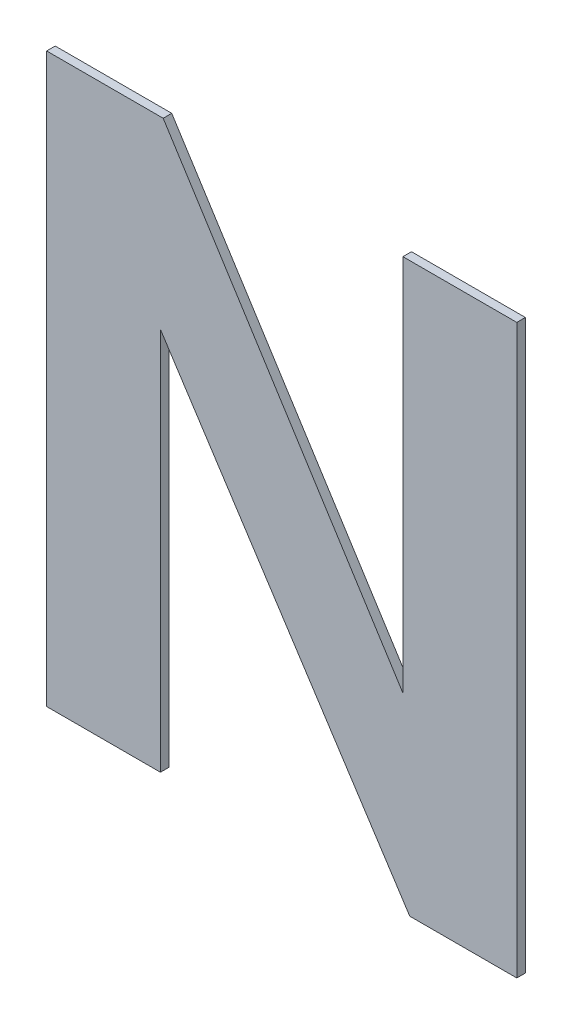
ISO-10303-21;
HEADER;
FILE_DESCRIPTION(('STEP AP214'),'2;1');
FILE_NAME('part.step','',(''),(''),'','','');
FILE_SCHEMA(('AUTOMOTIVE_DESIGN { 1 0 10303 214 1 1 1 1 }'));
ENDSEC;
DATA;
#1=APPLICATION_CONTEXT('core data for automotive mechanical design processes');
#2=APPLICATION_PROTOCOL_DEFINITION('international standard','automotive_design',2000,#1);
#3=PRODUCT_CONTEXT('',#1,'mechanical');
#4=PRODUCT('Part','Part','',(#3));
#5=PRODUCT_RELATED_PRODUCT_CATEGORY('part','',(#4));
#6=PRODUCT_DEFINITION_FORMATION('','',#4);
#7=PRODUCT_DEFINITION_CONTEXT('part definition',#1,'design');
#8=PRODUCT_DEFINITION('design','',#6,#7);
#9=PRODUCT_DEFINITION_SHAPE('','',#8);
#10=(LENGTH_UNIT() NAMED_UNIT(*) SI_UNIT(.MILLI.,.METRE.));
#11=(NAMED_UNIT(*) PLANE_ANGLE_UNIT() SI_UNIT($,.RADIAN.));
#12=(NAMED_UNIT(*) SI_UNIT($,.STERADIAN.) SOLID_ANGLE_UNIT());
#13=UNCERTAINTY_MEASURE_WITH_UNIT(LENGTH_MEASURE(1.E-05),#10,'distance_accuracy_value','');
#14=(GEOMETRIC_REPRESENTATION_CONTEXT(3) GLOBAL_UNCERTAINTY_ASSIGNED_CONTEXT((#13)) GLOBAL_UNIT_ASSIGNED_CONTEXT((#10,
#11,#12)) REPRESENTATION_CONTEXT('',''));
#15=CARTESIAN_POINT('',(0.,0.,0.));
#16=DIRECTION('',(0.,0.,1.));
#17=DIRECTION('',(1.,0.,0.));
#18=AXIS2_PLACEMENT_3D('',#15,#16,#17);
#19=CARTESIAN_POINT('',(3.0557891120453,-0.677335704041417,0.));
#20=DIRECTION('',(0.,-1.,0.));
#21=DIRECTION('',(1.,0.,0.));
#22=AXIS2_PLACEMENT_3D('',#19,#20,#21);
#23=PLANE('',#22);
#24=DIRECTION('',(1.,0.,0.));
#25=VECTOR('',#24,1.);
#26=CARTESIAN_POINT('',(3.0557891120453,-0.677335704041417,0.));
#27=LINE('',#26,#25);
#28=CARTESIAN_POINT('',(3.0557891120453,-0.677335704041417,0.));
#29=VERTEX_POINT('',#28);
#30=CARTESIAN_POINT('',(3.0956408964429,-0.677335704041417,0.));
#31=VERTEX_POINT('',#30);
#32=EDGE_CURVE('E11',#29,#31,#27,.T.);
#33=ORIENTED_EDGE('',*,*,#32,.T.);
#34=DIRECTION('',(0.,0.,1.));
#35=VECTOR('',#34,1.);
#36=CARTESIAN_POINT('',(3.0956408964429,-0.677335704041417,0.));
#37=LINE('',#36,#35);
#38=CARTESIAN_POINT('',(3.0956408964429,-0.677335704041417,0.003));
#39=VERTEX_POINT('',#38);
#40=EDGE_CURVE('E24',#31,#39,#37,.T.);
#41=ORIENTED_EDGE('',*,*,#40,.T.);
#42=DIRECTION('',(1.,0.,0.));
#43=VECTOR('',#42,1.);
#44=CARTESIAN_POINT('',(3.0557891120453,-0.677335704041417,0.003));
#45=LINE('',#44,#43);
#46=CARTESIAN_POINT('',(3.0557891120453,-0.677335704041417,0.003));
#47=VERTEX_POINT('',#46);
#48=EDGE_CURVE('E112',#47,#39,#45,.T.);
#49=ORIENTED_EDGE('',*,*,#48,.F.);
#50=DIRECTION('',(0.,0.,1.));
#51=VECTOR('',#50,1.);
#52=CARTESIAN_POINT('',(3.0557891120453,-0.677335704041417,0.));
#53=LINE('',#52,#51);
#54=EDGE_CURVE('E176',#29,#47,#53,.T.);
#55=ORIENTED_EDGE('',*,*,#54,.F.);
#56=EDGE_LOOP('',(#33,#41,#49,#55));
#57=FACE_BOUND('',#56,.T.);
#58=ADVANCED_FACE('F17',(#57),#23,.T.);
#59=CARTESIAN_POINT('',(3.0557891120453,-0.478504002276747,0.));
#60=DIRECTION('',(-1.,0.,0.));
#61=DIRECTION('',(0.,-1.,0.));
#62=AXIS2_PLACEMENT_3D('',#59,#60,#61);
#63=PLANE('',#62);
#64=DIRECTION('',(0.,-1.,0.));
#65=VECTOR('',#64,1.);
#66=CARTESIAN_POINT('',(3.0557891120453,-0.478504002276747,0.));
#67=LINE('',#66,#65);
#68=CARTESIAN_POINT('',(3.0557891120453,-0.478504002276747,0.));
#69=VERTEX_POINT('',#68);
#70=EDGE_CURVE('E173',#69,#29,#67,.T.);
#71=ORIENTED_EDGE('',*,*,#70,.T.);
#72=ORIENTED_EDGE('',*,*,#54,.T.);
#73=DIRECTION('',(0.,-1.,0.));
#74=VECTOR('',#73,1.);
#75=CARTESIAN_POINT('',(3.0557891120453,-0.478504002276747,0.003));
#76=LINE('',#75,#74);
#77=CARTESIAN_POINT('',(3.0557891120453,-0.478504002276747,0.003));
#78=VERTEX_POINT('',#77);
#79=EDGE_CURVE('E171',#78,#47,#76,.T.);
#80=ORIENTED_EDGE('',*,*,#79,.F.);
#81=DIRECTION('',(0.,0.,1.));
#82=VECTOR('',#81,1.);
#83=CARTESIAN_POINT('',(3.0557891120453,-0.478504002276747,0.));
#84=LINE('',#83,#82);
#85=EDGE_CURVE('E168',#69,#78,#84,.T.);
#86=ORIENTED_EDGE('',*,*,#85,.F.);
#87=EDGE_LOOP('',(#71,#72,#80,#86));
#88=FACE_BOUND('',#87,.T.);
#89=ADVANCED_FACE('F199',(#88),#63,.T.);
#90=CARTESIAN_POINT('',(3.0966033260352,-0.478504002276747,0.));
#91=DIRECTION('',(0.,1.,0.));
#92=DIRECTION('',(-1.,0.,0.));
#93=AXIS2_PLACEMENT_3D('',#90,#91,#92);
#94=PLANE('',#93);
#95=DIRECTION('',(-1.,0.,0.));
#96=VECTOR('',#95,1.);
#97=CARTESIAN_POINT('',(3.0966033260352,-0.478504002276747,0.));
#98=LINE('',#97,#96);
#99=CARTESIAN_POINT('',(3.0966033260352,-0.478504002276747,0.));
#100=VERTEX_POINT('',#99);
#101=EDGE_CURVE('E165',#100,#69,#98,.T.);
#102=ORIENTED_EDGE('',*,*,#101,.T.);
#103=ORIENTED_EDGE('',*,*,#85,.T.);
#104=DIRECTION('',(-1.,0.,0.));
#105=VECTOR('',#104,1.);
#106=CARTESIAN_POINT('',(3.0966033260352,-0.478504002276747,0.003));
#107=LINE('',#106,#105);
#108=CARTESIAN_POINT('',(3.0966033260352,-0.478504002276747,0.003));
#109=VERTEX_POINT('',#108);
#110=EDGE_CURVE('E162',#109,#78,#107,.T.);
#111=ORIENTED_EDGE('',*,*,#110,.F.);
#112=DIRECTION('',(0.,0.,1.));
#113=VECTOR('',#112,1.);
#114=CARTESIAN_POINT('',(3.0966033260352,-0.478504002276747,0.));
#115=LINE('',#114,#113);
#116=EDGE_CURVE('E159',#100,#109,#115,.T.);
#117=ORIENTED_EDGE('',*,*,#116,.F.);
#118=EDGE_LOOP('',(#102,#103,#111,#117));
#119=FACE_BOUND('',#118,.T.);
#120=ADVANCED_FACE('F196',(#119),#94,.T.);
#121=CARTESIAN_POINT('',(3.1805658352308,-0.610889223970799,0.));
#122=DIRECTION('',(0.844477115493198,0.535591636798306,0.));
#123=DIRECTION('',(-0.535591636798306,0.844477115493198,0.));
#124=AXIS2_PLACEMENT_3D('',#121,#122,#123);
#125=PLANE('',#124);
#126=DIRECTION('',(-0.535591636798306,0.844477115493198,0.));
#127=VECTOR('',#126,1.);
#128=CARTESIAN_POINT('',(3.1805658352308,-0.610889223970799,0.));
#129=LINE('',#128,#127);
#130=CARTESIAN_POINT('',(3.1805658352308,-0.610889223970799,0.));
#131=VERTEX_POINT('',#130);
#132=EDGE_CURVE('E156',#131,#100,#129,.T.);
#133=ORIENTED_EDGE('',*,*,#132,.T.);
#134=ORIENTED_EDGE('',*,*,#116,.T.);
#135=DIRECTION('',(-0.535591636798306,0.844477115493198,0.));
#136=VECTOR('',#135,1.);
#137=CARTESIAN_POINT('',(3.1805658352308,-0.610889223970799,0.003));
#138=LINE('',#137,#136);
#139=CARTESIAN_POINT('',(3.1805658352308,-0.610889223970799,0.003));
#140=VERTEX_POINT('',#139);
#141=EDGE_CURVE('E153',#140,#109,#138,.T.);
#142=ORIENTED_EDGE('',*,*,#141,.F.);
#143=DIRECTION('',(0.,0.,1.));
#144=VECTOR('',#143,1.);
#145=CARTESIAN_POINT('',(3.1805658352308,-0.610889223970799,0.));
#146=LINE('',#145,#144);
#147=EDGE_CURVE('E150',#131,#140,#146,.T.);
#148=ORIENTED_EDGE('',*,*,#147,.F.);
#149=EDGE_LOOP('',(#133,#134,#142,#148));
#150=FACE_BOUND('',#149,.T.);
#151=ADVANCED_FACE('F193',(#150),#125,.T.);
#152=CARTESIAN_POINT('',(3.1805658352308,-0.478504002276747,0.));
#153=DIRECTION('',(-1.,0.,0.));
#154=DIRECTION('',(0.,-1.,0.));
#155=AXIS2_PLACEMENT_3D('',#152,#153,#154);
#156=PLANE('',#155);
#157=DIRECTION('',(0.,-1.,0.));
#158=VECTOR('',#157,1.);
#159=CARTESIAN_POINT('',(3.1805658352308,-0.478504002276747,0.));
#160=LINE('',#159,#158);
#161=CARTESIAN_POINT('',(3.1805658352308,-0.478504002276747,0.));
#162=VERTEX_POINT('',#161);
#163=EDGE_CURVE('E147',#162,#131,#160,.T.);
#164=ORIENTED_EDGE('',*,*,#163,.T.);
#165=ORIENTED_EDGE('',*,*,#147,.T.);
#166=DIRECTION('',(0.,-1.,0.));
#167=VECTOR('',#166,1.);
#168=CARTESIAN_POINT('',(3.1805658352308,-0.478504002276747,0.003));
#169=LINE('',#168,#167);
#170=CARTESIAN_POINT('',(3.1805658352308,-0.478504002276747,0.003));
#171=VERTEX_POINT('',#170);
#172=EDGE_CURVE('E144',#171,#140,#169,.T.);
#173=ORIENTED_EDGE('',*,*,#172,.F.);
#174=DIRECTION('',(0.,0.,1.));
#175=VECTOR('',#174,1.);
#176=CARTESIAN_POINT('',(3.1805658352308,-0.478504002276747,0.));
#177=LINE('',#176,#175);
#178=EDGE_CURVE('E141',#162,#171,#177,.T.);
#179=ORIENTED_EDGE('',*,*,#178,.F.);
#180=EDGE_LOOP('',(#164,#165,#173,#179));
#181=FACE_BOUND('',#180,.T.);
#182=ADVANCED_FACE('F190',(#181),#156,.T.);
#183=CARTESIAN_POINT('',(3.2204365650928,-0.478504002276747,0.));
#184=DIRECTION('',(0.,1.,0.));
#185=DIRECTION('',(-1.,0.,0.));
#186=AXIS2_PLACEMENT_3D('',#183,#184,#185);
#187=PLANE('',#186);
#188=DIRECTION('',(-1.,0.,0.));
#189=VECTOR('',#188,1.);
#190=CARTESIAN_POINT('',(3.2204365650928,-0.478504002276747,0.));
#191=LINE('',#190,#189);
#192=CARTESIAN_POINT('',(3.2204365650928,-0.478504002276747,0.));
#193=VERTEX_POINT('',#192);
#194=EDGE_CURVE('E138',#193,#162,#191,.T.);
#195=ORIENTED_EDGE('',*,*,#194,.T.);
#196=ORIENTED_EDGE('',*,*,#178,.T.);
#197=DIRECTION('',(-1.,0.,0.));
#198=VECTOR('',#197,1.);
#199=CARTESIAN_POINT('',(3.2204365650928,-0.478504002276747,0.003));
#200=LINE('',#199,#198);
#201=CARTESIAN_POINT('',(3.2204365650928,-0.478504002276747,0.003));
#202=VERTEX_POINT('',#201);
#203=EDGE_CURVE('E135',#202,#171,#200,.T.);
#204=ORIENTED_EDGE('',*,*,#203,.F.);
#205=DIRECTION('',(0.,0.,1.));
#206=VECTOR('',#205,1.);
#207=CARTESIAN_POINT('',(3.2204365650928,-0.478504002276747,0.));
#208=LINE('',#207,#206);
#209=EDGE_CURVE('E132',#193,#202,#208,.T.);
#210=ORIENTED_EDGE('',*,*,#209,.F.);
#211=EDGE_LOOP('',(#195,#196,#204,#210));
#212=FACE_BOUND('',#211,.T.);
#213=ADVANCED_FACE('F187',(#212),#187,.T.);
#214=CARTESIAN_POINT('',(3.2204365650928,-0.677335704041417,0.));
#215=DIRECTION('',(1.,0.,0.));
#216=DIRECTION('',(0.,1.,0.));
#217=AXIS2_PLACEMENT_3D('',#214,#215,#216);
#218=PLANE('',#217);
#219=DIRECTION('',(0.,1.,0.));
#220=VECTOR('',#219,1.);
#221=CARTESIAN_POINT('',(3.2204365650928,-0.677335704041417,0.));
#222=LINE('',#221,#220);
#223=CARTESIAN_POINT('',(3.2204365650928,-0.677335704041417,0.));
#224=VERTEX_POINT('',#223);
#225=EDGE_CURVE('E129',#224,#193,#222,.T.);
#226=ORIENTED_EDGE('',*,*,#225,.T.);
#227=ORIENTED_EDGE('',*,*,#209,.T.);
#228=DIRECTION('',(0.,1.,0.));
#229=VECTOR('',#228,1.);
#230=CARTESIAN_POINT('',(3.2204365650928,-0.677335704041417,0.003));
#231=LINE('',#230,#229);
#232=CARTESIAN_POINT('',(3.2204365650928,-0.677335704041417,0.003));
#233=VERTEX_POINT('',#232);
#234=EDGE_CURVE('E126',#233,#202,#231,.T.);
#235=ORIENTED_EDGE('',*,*,#234,.F.);
#236=DIRECTION('',(0.,0.,1.));
#237=VECTOR('',#236,1.);
#238=CARTESIAN_POINT('',(3.2204365650928,-0.677335704041417,0.));
#239=LINE('',#238,#237);
#240=EDGE_CURVE('E123',#224,#233,#239,.T.);
#241=ORIENTED_EDGE('',*,*,#240,.F.);
#242=EDGE_LOOP('',(#226,#227,#235,#241));
#243=FACE_BOUND('',#242,.T.);
#244=ADVANCED_FACE('F184',(#243),#218,.T.);
#245=CARTESIAN_POINT('',(3.182949174654,-0.677335704041417,0.));
#246=DIRECTION('',(0.,-1.,0.));
#247=DIRECTION('',(1.,0.,0.));
#248=AXIS2_PLACEMENT_3D('',#245,#246,#247);
#249=PLANE('',#248);
#250=DIRECTION('',(1.,0.,0.));
#251=VECTOR('',#250,1.);
#252=CARTESIAN_POINT('',(3.182949174654,-0.677335704041417,0.));
#253=LINE('',#252,#251);
#254=CARTESIAN_POINT('',(3.182949174654,-0.677335704041417,0.));
#255=VERTEX_POINT('',#254);
#256=EDGE_CURVE('E120',#255,#224,#253,.T.);
#257=ORIENTED_EDGE('',*,*,#256,.T.);
#258=ORIENTED_EDGE('',*,*,#240,.T.);
#259=DIRECTION('',(1.,0.,0.));
#260=VECTOR('',#259,1.);
#261=CARTESIAN_POINT('',(3.182949174654,-0.677335704041417,0.003));
#262=LINE('',#261,#260);
#263=CARTESIAN_POINT('',(3.182949174654,-0.677335704041417,0.003));
#264=VERTEX_POINT('',#263);
#265=EDGE_CURVE('E118',#264,#233,#262,.T.);
#266=ORIENTED_EDGE('',*,*,#265,.F.);
#267=DIRECTION('',(0.,0.,1.));
#268=VECTOR('',#267,1.);
#269=CARTESIAN_POINT('',(3.182949174654,-0.677335704041417,0.));
#270=LINE('',#269,#268);
#271=EDGE_CURVE('E97',#255,#264,#270,.T.);
#272=ORIENTED_EDGE('',*,*,#271,.F.);
#273=EDGE_LOOP('',(#257,#258,#266,#272));
#274=FACE_BOUND('',#273,.T.);
#275=ADVANCED_FACE('F182',(#274),#249,.T.);
#276=CARTESIAN_POINT('',(3.0956408964429,-0.543022781342882,0.));
#277=DIRECTION('',(-0.838429700732419,-0.545009758563777,0.));
#278=DIRECTION('',(0.545009758563777,-0.838429700732419,0.));
#279=AXIS2_PLACEMENT_3D('',#276,#277,#278);
#280=PLANE('',#279);
#281=DIRECTION('',(0.545009758563777,-0.838429700732419,0.));
#282=VECTOR('',#281,1.);
#283=CARTESIAN_POINT('',(3.0956408964429,-0.543022781342882,0.));
#284=LINE('',#283,#282);
#285=CARTESIAN_POINT('',(3.0956408964429,-0.543022781342882,0.));
#286=VERTEX_POINT('',#285);
#287=EDGE_CURVE('E101',#286,#255,#284,.T.);
#288=ORIENTED_EDGE('',*,*,#287,.T.);
#289=ORIENTED_EDGE('',*,*,#271,.T.);
#290=DIRECTION('',(0.545009758563777,-0.838429700732419,0.));
#291=VECTOR('',#290,1.);
#292=CARTESIAN_POINT('',(3.0956408964429,-0.543022781342882,0.003));
#293=LINE('',#292,#291);
#294=CARTESIAN_POINT('',(3.0956408964429,-0.543022781342882,0.003));
#295=VERTEX_POINT('',#294);
#296=EDGE_CURVE('E90',#295,#264,#293,.T.);
#297=ORIENTED_EDGE('',*,*,#296,.F.);
#298=DIRECTION('',(0.,0.,1.));
#299=VECTOR('',#298,1.);
#300=CARTESIAN_POINT('',(3.0956408964429,-0.543022781342882,0.));
#301=LINE('',#300,#299);
#302=EDGE_CURVE('E94',#286,#295,#301,.T.);
#303=ORIENTED_EDGE('',*,*,#302,.F.);
#304=EDGE_LOOP('',(#288,#289,#297,#303));
#305=FACE_BOUND('',#304,.T.);
#306=ADVANCED_FACE('F93',(#305),#280,.T.);
#307=CARTESIAN_POINT('',(3.0956408964429,-0.677335704041417,0.));
#308=DIRECTION('',(1.,0.,0.));
#309=DIRECTION('',(0.,1.,0.));
#310=AXIS2_PLACEMENT_3D('',#307,#308,#309);
#311=PLANE('',#310);
#312=DIRECTION('',(0.,1.,0.));
#313=VECTOR('',#312,1.);
#314=CARTESIAN_POINT('',(3.0956408964429,-0.677335704041417,0.));
#315=LINE('',#314,#313);
#316=EDGE_CURVE('E107',#31,#286,#315,.T.);
#317=ORIENTED_EDGE('',*,*,#316,.T.);
#318=ORIENTED_EDGE('',*,*,#302,.T.);
#319=DIRECTION('',(0.,1.,0.));
#320=VECTOR('',#319,1.);
#321=CARTESIAN_POINT('',(3.0956408964429,-0.677335704041417,0.003));
#322=LINE('',#321,#320);
#323=EDGE_CURVE('E106',#39,#295,#322,.T.);
#324=ORIENTED_EDGE('',*,*,#323,.F.);
#325=ORIENTED_EDGE('',*,*,#40,.F.);
#326=EDGE_LOOP('',(#317,#318,#324,#325));
#327=FACE_BOUND('',#326,.T.);
#328=ADVANCED_FACE('F105',(#327),#311,.T.);
#329=CARTESIAN_POINT('',(3.138112838569,-0.577919853159082,0.003));
#330=DIRECTION('',(0.,0.,1.));
#331=DIRECTION('',(1.,0.,0.));
#332=AXIS2_PLACEMENT_3D('',#329,#330,#331);
#333=PLANE('',#332);
#334=ORIENTED_EDGE('',*,*,#323,.T.);
#335=ORIENTED_EDGE('',*,*,#296,.T.);
#336=ORIENTED_EDGE('',*,*,#265,.T.);
#337=ORIENTED_EDGE('',*,*,#234,.T.);
#338=ORIENTED_EDGE('',*,*,#203,.T.);
#339=ORIENTED_EDGE('',*,*,#172,.T.);
#340=ORIENTED_EDGE('',*,*,#141,.T.);
#341=ORIENTED_EDGE('',*,*,#110,.T.);
#342=ORIENTED_EDGE('',*,*,#79,.T.);
#343=ORIENTED_EDGE('',*,*,#48,.T.);
#344=EDGE_LOOP('',(#334,#335,#336,#337,#338,#339,#340,#341,#342,#343));
#345=FACE_BOUND('',#344,.T.);
#346=ADVANCED_FACE('F110',(#345),#333,.T.);
#347=CARTESIAN_POINT('',(3.138112838569,-0.577919853159082,0.));
#348=DIRECTION('',(0.,0.,1.));
#349=DIRECTION('',(1.,0.,0.));
#350=AXIS2_PLACEMENT_3D('',#347,#348,#349);
#351=PLANE('',#350);
#352=ORIENTED_EDGE('',*,*,#316,.F.);
#353=ORIENTED_EDGE('',*,*,#32,.F.);
#354=ORIENTED_EDGE('',*,*,#70,.F.);
#355=ORIENTED_EDGE('',*,*,#101,.F.);
#356=ORIENTED_EDGE('',*,*,#132,.F.);
#357=ORIENTED_EDGE('',*,*,#163,.F.);
#358=ORIENTED_EDGE('',*,*,#194,.F.);
#359=ORIENTED_EDGE('',*,*,#225,.F.);
#360=ORIENTED_EDGE('',*,*,#256,.F.);
#361=ORIENTED_EDGE('',*,*,#287,.F.);
#362=EDGE_LOOP('',(#352,#353,#354,#355,#356,#357,#358,#359,#360,#361));
#363=FACE_BOUND('',#362,.T.);
#364=ADVANCED_FACE('F179',(#363),#351,.F.);
#365=CLOSED_SHELL('',(#58,#89,#120,#151,#182,#213,#244,#275,#306,#328,#346,#364));
#366=MANIFOLD_SOLID_BREP('B1',#365);
#367=ADVANCED_BREP_SHAPE_REPRESENTATION('',(#18,#366),#14);
#368=SHAPE_DEFINITION_REPRESENTATION(#9,#367);
ENDSEC;
END-ISO-10303-21;
